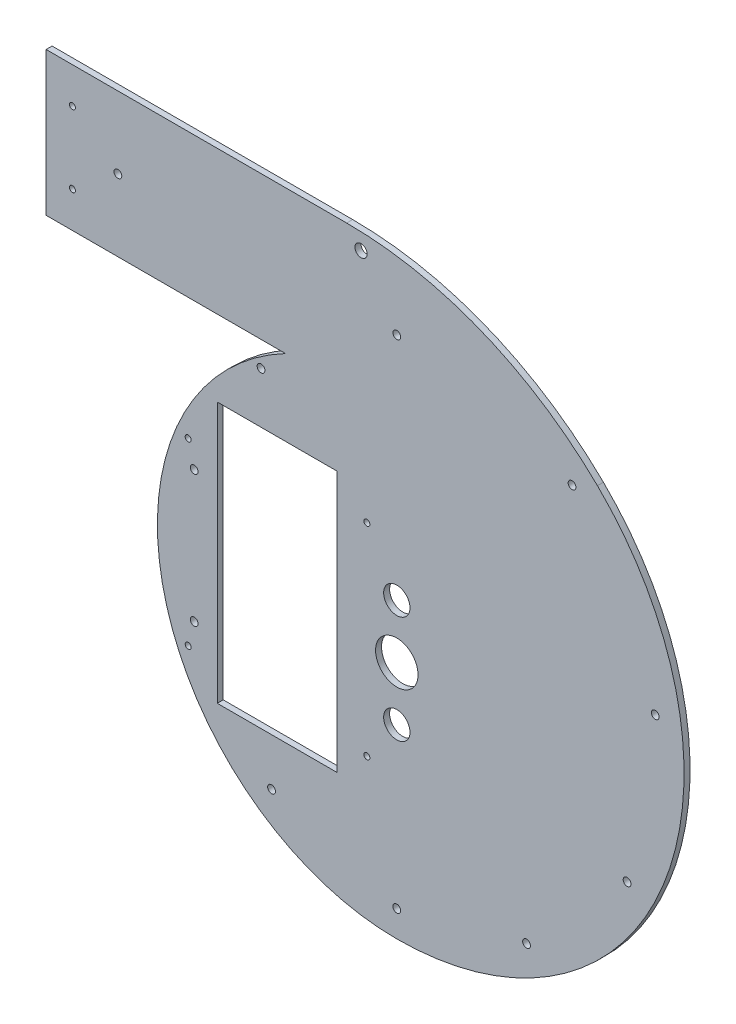
ISO-10303-21;
HEADER;
FILE_DESCRIPTION(('STEP AP214'),'2;1');
FILE_NAME('part.step','',(''),(''),'','','');
FILE_SCHEMA(('AUTOMOTIVE_DESIGN { 1 0 10303 214 1 1 1 1 }'));
ENDSEC;
DATA;
#1=APPLICATION_CONTEXT('core data for automotive mechanical design processes');
#2=APPLICATION_PROTOCOL_DEFINITION('international standard','automotive_design',2000,#1);
#3=PRODUCT_CONTEXT('',#1,'mechanical');
#4=PRODUCT('Part','Part','',(#3));
#5=PRODUCT_RELATED_PRODUCT_CATEGORY('part','',(#4));
#6=PRODUCT_DEFINITION_FORMATION('','',#4);
#7=PRODUCT_DEFINITION_CONTEXT('part definition',#1,'design');
#8=PRODUCT_DEFINITION('design','',#6,#7);
#9=PRODUCT_DEFINITION_SHAPE('','',#8);
#10=(LENGTH_UNIT() NAMED_UNIT(*) SI_UNIT(.MILLI.,.METRE.));
#11=(NAMED_UNIT(*) PLANE_ANGLE_UNIT() SI_UNIT($,.RADIAN.));
#12=(NAMED_UNIT(*) SI_UNIT($,.STERADIAN.) SOLID_ANGLE_UNIT());
#13=UNCERTAINTY_MEASURE_WITH_UNIT(LENGTH_MEASURE(1.E-05),#10,'distance_accuracy_value','');
#14=(GEOMETRIC_REPRESENTATION_CONTEXT(3) GLOBAL_UNCERTAINTY_ASSIGNED_CONTEXT((#13)) GLOBAL_UNIT_ASSIGNED_CONTEXT((#10,
#11,#12)) REPRESENTATION_CONTEXT('',''));
#15=CARTESIAN_POINT('',(0.,0.,0.));
#16=DIRECTION('',(0.,0.,1.));
#17=DIRECTION('',(1.,0.,0.));
#18=AXIS2_PLACEMENT_3D('',#15,#16,#17);
#19=CARTESIAN_POINT('',(-93.006306293609,177.058823529412,-5.));
#20=DIRECTION('',(0.,-1.,0.));
#21=DIRECTION('',(0.,0.,-1.));
#22=AXIS2_PLACEMENT_3D('',#19,#20,#21);
#23=PLANE('',#22);
#24=DIRECTION('',(1.,0.,0.));
#25=VECTOR('',#24,1.);
#26=CARTESIAN_POINT('',(-93.006306293609,177.058823529412,0.));
#27=LINE('',#26,#25);
#28=CARTESIAN_POINT('',(-293.006306293609,177.058823529412,0.));
#29=VERTEX_POINT('',#28);
#30=CARTESIAN_POINT('',(-93.006306293609,177.058823529412,0.));
#31=VERTEX_POINT('',#30);
#32=EDGE_CURVE('E243',#29,#31,#27,.T.);
#33=ORIENTED_EDGE('',*,*,#32,.F.);
#34=DIRECTION('',(0.,0.,1.));
#35=VECTOR('',#34,1.);
#36=CARTESIAN_POINT('',(-293.006306293609,177.058823529412,-5.));
#37=LINE('',#36,#35);
#38=CARTESIAN_POINT('',(-293.006306293609,177.058823529412,-5.));
#39=VERTEX_POINT('',#38);
#40=EDGE_CURVE('E45',#39,#29,#37,.T.);
#41=ORIENTED_EDGE('',*,*,#40,.F.);
#42=DIRECTION('',(1.,0.,0.));
#43=VECTOR('',#42,1.);
#44=CARTESIAN_POINT('',(-93.006306293609,177.058823529412,-5.));
#45=LINE('',#44,#43);
#46=CARTESIAN_POINT('',(-93.006306293609,177.058823529412,-5.));
#47=VERTEX_POINT('',#46);
#48=EDGE_CURVE('E255',#39,#47,#45,.T.);
#49=ORIENTED_EDGE('',*,*,#48,.T.);
#50=DIRECTION('',(0.,0.,1.));
#51=VECTOR('',#50,1.);
#52=CARTESIAN_POINT('',(-93.006306293609,177.058823529412,-5.));
#53=LINE('',#52,#51);
#54=EDGE_CURVE('E11',#47,#31,#53,.T.);
#55=ORIENTED_EDGE('',*,*,#54,.T.);
#56=EDGE_LOOP('',(#33,#41,#49,#55));
#57=FACE_BOUND('',#56,.T.);
#58=ADVANCED_FACE('F36',(#57),#23,.T.);
#59=CARTESIAN_POINT('',(-293.006306293609,297.058823529412,-5.));
#60=DIRECTION('',(-1.,0.,0.));
#61=DIRECTION('',(0.,0.,1.));
#62=AXIS2_PLACEMENT_3D('',#59,#60,#61);
#63=PLANE('',#62);
#64=DIRECTION('',(0.,-1.,0.));
#65=VECTOR('',#64,1.);
#66=CARTESIAN_POINT('',(-293.006306293609,297.058823529412,0.));
#67=LINE('',#66,#65);
#68=CARTESIAN_POINT('',(-293.006306293609,297.058823529412,0.));
#69=VERTEX_POINT('',#68);
#70=EDGE_CURVE('E269',#69,#29,#67,.T.);
#71=ORIENTED_EDGE('',*,*,#70,.F.);
#72=DIRECTION('',(0.,0.,1.));
#73=VECTOR('',#72,1.);
#74=CARTESIAN_POINT('',(-293.006306293609,297.058823529412,-5.));
#75=LINE('',#74,#73);
#76=CARTESIAN_POINT('',(-293.006306293609,297.058823529412,-5.));
#77=VERTEX_POINT('',#76);
#78=EDGE_CURVE('E275',#77,#69,#75,.T.);
#79=ORIENTED_EDGE('',*,*,#78,.F.);
#80=DIRECTION('',(0.,-1.,0.));
#81=VECTOR('',#80,1.);
#82=CARTESIAN_POINT('',(-293.006306293609,297.058823529412,-5.));
#83=LINE('',#82,#81);
#84=EDGE_CURVE('E252',#77,#39,#83,.T.);
#85=ORIENTED_EDGE('',*,*,#84,.T.);
#86=ORIENTED_EDGE('',*,*,#40,.T.);
#87=EDGE_LOOP('',(#71,#79,#85,#86));
#88=FACE_BOUND('',#87,.T.);
#89=ADVANCED_FACE('F303',(#88),#63,.T.);
#90=CARTESIAN_POINT('',(-41.905314261103,297.058823529412,-5.));
#91=DIRECTION('',(0.,1.,0.));
#92=DIRECTION('',(0.,0.,1.));
#93=AXIS2_PLACEMENT_3D('',#90,#91,#92);
#94=PLANE('',#93);
#95=DIRECTION('',(-1.,0.,0.));
#96=VECTOR('',#95,1.);
#97=CARTESIAN_POINT('',(-41.905314261103,297.058823529412,0.));
#98=LINE('',#97,#96);
#99=CARTESIAN_POINT('',(-41.905314261103,297.058823529412,0.));
#100=VERTEX_POINT('',#99);
#101=EDGE_CURVE('E266',#100,#69,#98,.T.);
#102=ORIENTED_EDGE('',*,*,#101,.F.);
#103=DIRECTION('',(0.,0.,1.));
#104=VECTOR('',#103,1.);
#105=CARTESIAN_POINT('',(-41.905314261103,297.058823529412,-5.));
#106=LINE('',#105,#104);
#107=CARTESIAN_POINT('',(-41.905314261103,297.058823529412,-5.));
#108=VERTEX_POINT('',#107);
#109=EDGE_CURVE('E277',#108,#100,#106,.T.);
#110=ORIENTED_EDGE('',*,*,#109,.F.);
#111=DIRECTION('',(-1.,0.,0.));
#112=VECTOR('',#111,1.);
#113=CARTESIAN_POINT('',(-41.905314261103,297.058823529412,-5.));
#114=LINE('',#113,#112);
#115=EDGE_CURVE('E249',#108,#77,#114,.T.);
#116=ORIENTED_EDGE('',*,*,#115,.T.);
#117=ORIENTED_EDGE('',*,*,#78,.T.);
#118=EDGE_LOOP('',(#102,#110,#116,#117));
#119=FACE_BOUND('',#118,.T.);
#120=ADVANCED_FACE('F301',(#119),#94,.T.);
#121=CARTESIAN_POINT('',(-41.905314261103,-2.94117647058825,-5.));
#122=DIRECTION('',(0.,0.,1.));
#123=DIRECTION('',(1.,0.,0.));
#124=AXIS2_PLACEMENT_3D('',#121,#122,#123);
#125=CYLINDRICAL_SURFACE('',#124,300.);
#126=CARTESIAN_POINT('',(-41.905314261103,-2.94117647058825,0.));
#127=DIRECTION('',(0.,0.,1.));
#128=DIRECTION('',(1.,0.,0.));
#129=AXIS2_PLACEMENT_3D('',#126,#127,#128);
#130=CIRCLE('',#129,300.);
#131=CARTESIAN_POINT('',(167.621257044412,211.764705882353,0.));
#132=VERTEX_POINT('',#131);
#133=EDGE_CURVE('E263',#132,#100,#130,.T.);
#134=ORIENTED_EDGE('',*,*,#133,.F.);
#135=DIRECTION('',(0.,0.,1.));
#136=VECTOR('',#135,1.);
#137=CARTESIAN_POINT('',(167.621257044412,211.764705882353,-5.));
#138=LINE('',#137,#136);
#139=CARTESIAN_POINT('',(167.621257044412,211.764705882353,-5.));
#140=VERTEX_POINT('',#139);
#141=EDGE_CURVE('E278',#140,#132,#138,.T.);
#142=ORIENTED_EDGE('',*,*,#141,.F.);
#143=CARTESIAN_POINT('',(-41.905314261103,-2.94117647058825,-5.));
#144=DIRECTION('',(0.,0.,1.));
#145=DIRECTION('',(1.,0.,0.));
#146=AXIS2_PLACEMENT_3D('',#143,#144,#145);
#147=CIRCLE('',#146,300.);
#148=EDGE_CURVE('E246',#140,#108,#147,.T.);
#149=ORIENTED_EDGE('',*,*,#148,.T.);
#150=ORIENTED_EDGE('',*,*,#109,.T.);
#151=EDGE_LOOP('',(#134,#142,#149,#150));
#152=FACE_BOUND('',#151,.T.);
#153=ADVANCED_FACE('F298',(#152),#125,.T.);
#154=CARTESIAN_POINT('',(0.,40.,-5.));
#155=DIRECTION('',(0.,0.,1.));
#156=DIRECTION('',(1.,0.,0.));
#157=AXIS2_PLACEMENT_3D('',#154,#155,#156);
#158=CYLINDRICAL_SURFACE('',#157,240.);
#159=CARTESIAN_POINT('',(0.,40.,0.));
#160=DIRECTION('',(0.,0.,1.));
#161=DIRECTION('',(1.,0.,0.));
#162=AXIS2_PLACEMENT_3D('',#159,#160,#161);
#163=CIRCLE('',#162,240.);
#164=CARTESIAN_POINT('',(0.,-200.,0.));
#165=VERTEX_POINT('',#164);
#166=EDGE_CURVE('E260',#165,#132,#163,.T.);
#167=ORIENTED_EDGE('',*,*,#166,.F.);
#168=DIRECTION('',(0.,0.,1.));
#169=VECTOR('',#168,1.);
#170=CARTESIAN_POINT('',(0.,-200.,-5.));
#171=LINE('',#170,#169);
#172=CARTESIAN_POINT('',(0.,-200.,-5.));
#173=VERTEX_POINT('',#172);
#174=EDGE_CURVE('E40',#173,#165,#171,.T.);
#175=ORIENTED_EDGE('',*,*,#174,.F.);
#176=CARTESIAN_POINT('',(0.,40.,-5.));
#177=DIRECTION('',(0.,0.,1.));
#178=DIRECTION('',(1.,0.,0.));
#179=AXIS2_PLACEMENT_3D('',#176,#177,#178);
#180=CIRCLE('',#179,240.);
#181=EDGE_CURVE('E242',#173,#140,#180,.T.);
#182=ORIENTED_EDGE('',*,*,#181,.T.);
#183=ORIENTED_EDGE('',*,*,#141,.T.);
#184=EDGE_LOOP('',(#167,#175,#182,#183));
#185=FACE_BOUND('',#184,.T.);
#186=ADVANCED_FACE('F286',(#185),#158,.T.);
#187=CARTESIAN_POINT('',(0.,0.,-5.));
#188=DIRECTION('',(0.,0.,1.));
#189=DIRECTION('',(1.,0.,0.));
#190=AXIS2_PLACEMENT_3D('',#187,#188,#189);
#191=CYLINDRICAL_SURFACE('',#190,200.);
#192=CARTESIAN_POINT('',(0.,0.,0.));
#193=DIRECTION('',(0.,0.,1.));
#194=DIRECTION('',(1.,0.,0.));
#195=AXIS2_PLACEMENT_3D('',#192,#193,#194);
#196=CIRCLE('',#195,200.);
#197=EDGE_CURVE('E237',#31,#165,#196,.T.);
#198=ORIENTED_EDGE('',*,*,#197,.F.);
#199=ORIENTED_EDGE('',*,*,#54,.F.);
#200=CARTESIAN_POINT('',(0.,0.,-5.));
#201=DIRECTION('',(0.,0.,1.));
#202=DIRECTION('',(-1.,0.,0.));
#203=AXIS2_PLACEMENT_3D('',#200,#201,#202);
#204=CIRCLE('',#203,200.);
#205=EDGE_CURVE('E240',#47,#173,#204,.T.);
#206=ORIENTED_EDGE('',*,*,#205,.T.);
#207=ORIENTED_EDGE('',*,*,#174,.T.);
#208=EDGE_LOOP('',(#198,#199,#206,#207));
#209=FACE_BOUND('',#208,.T.);
#210=ADVANCED_FACE('F38',(#209),#191,.T.);
#211=CARTESIAN_POINT('',(0.,0.,-5.));
#212=DIRECTION('',(0.,0.,-1.));
#213=DIRECTION('',(-1.,0.,0.));
#214=AXIS2_PLACEMENT_3D('',#211,#212,#213);
#215=PLANE('',#214);
#216=CARTESIAN_POINT('',(-271.006306293609,207.058823529412,-5.));
#217=DIRECTION('',(0.,0.,1.));
#218=DIRECTION('',(1.,0.,0.));
#219=AXIS2_PLACEMENT_3D('',#216,#217,#218);
#220=CIRCLE('',#219,2.50000000000002);
#221=CARTESIAN_POINT('',(-268.506306293609,207.058823529412,-5.));
#222=VERTEX_POINT('',#221);
#223=EDGE_CURVE('E430',#222,#222,#220,.T.);
#224=ORIENTED_EDGE('',*,*,#223,.T.);
#225=EDGE_LOOP('',(#224));
#226=FACE_BOUND('',#225,.T.);
#227=CARTESIAN_POINT('',(-271.006306293609,267.058823529412,-5.));
#228=DIRECTION('',(0.,0.,1.));
#229=DIRECTION('',(-1.,0.,0.));
#230=AXIS2_PLACEMENT_3D('',#227,#228,#229);
#231=CIRCLE('',#230,2.50000000000002);
#232=CARTESIAN_POINT('',(-273.506306293609,267.058823529412,-5.));
#233=VERTEX_POINT('',#232);
#234=EDGE_CURVE('E434',#233,#233,#231,.T.);
#235=ORIENTED_EDGE('',*,*,#234,.T.);
#236=EDGE_LOOP('',(#235));
#237=FACE_BOUND('',#236,.T.);
#238=CARTESIAN_POINT('',(-25.,-80.3,-5.));
#239=DIRECTION('',(0.,0.,-1.));
#240=DIRECTION('',(-1.,0.,0.));
#241=AXIS2_PLACEMENT_3D('',#238,#239,#240);
#242=CIRCLE('',#241,2.5);
#243=CARTESIAN_POINT('',(-27.5,-80.3,-5.));
#244=VERTEX_POINT('',#243);
#245=EDGE_CURVE('E436',#244,#244,#242,.F.);
#246=ORIENTED_EDGE('',*,*,#245,.T.);
#247=EDGE_LOOP('',(#246));
#248=FACE_BOUND('',#247,.T.);
#249=CARTESIAN_POINT('',(-25.,88.7,-5.));
#250=DIRECTION('',(0.,0.,-1.));
#251=DIRECTION('',(-1.,0.,0.));
#252=AXIS2_PLACEMENT_3D('',#249,#250,#251);
#253=CIRCLE('',#252,2.5);
#254=CARTESIAN_POINT('',(-27.5,88.7,-5.));
#255=VERTEX_POINT('',#254);
#256=EDGE_CURVE('E454',#255,#255,#253,.F.);
#257=ORIENTED_EDGE('',*,*,#256,.T.);
#258=EDGE_LOOP('',(#257));
#259=FACE_BOUND('',#258,.T.);
#260=CARTESIAN_POINT('',(-174.288059900537,-75.0050249987407,-5.));
#261=DIRECTION('',(0.,0.,-1.));
#262=DIRECTION('',(-1.,0.,0.));
#263=AXIS2_PLACEMENT_3D('',#260,#261,#262);
#264=CIRCLE('',#263,2.5);
#265=CARTESIAN_POINT('',(-176.788059900537,-75.0050249987407,-5.));
#266=VERTEX_POINT('',#265);
#267=EDGE_CURVE('E448',#266,#266,#264,.F.);
#268=ORIENTED_EDGE('',*,*,#267,.T.);
#269=EDGE_LOOP('',(#268));
#270=FACE_BOUND('',#269,.T.);
#271=CARTESIAN_POINT('',(-174.288059900537,75.0050249987407,-5.));
#272=DIRECTION('',(0.,0.,-1.));
#273=DIRECTION('',(-1.,0.,0.));
#274=AXIS2_PLACEMENT_3D('',#271,#272,#273);
#275=CIRCLE('',#274,2.5);
#276=CARTESIAN_POINT('',(-176.788059900537,75.0050249987407,-5.));
#277=VERTEX_POINT('',#276);
#278=EDGE_CURVE('E447',#277,#277,#275,.F.);
#279=ORIENTED_EDGE('',*,*,#278,.T.);
#280=EDGE_LOOP('',(#279));
#281=FACE_BOUND('',#280,.T.);
#282=DIRECTION('',(0.,-1.,0.));
#283=VECTOR('',#282,1.);
#284=CARTESIAN_POINT('',(-150.,113.5,-5.));
#285=LINE('',#284,#283);
#286=CARTESIAN_POINT('',(-150.,113.5,-5.));
#287=VERTEX_POINT('',#286);
#288=CARTESIAN_POINT('',(-150.,-104.5,-5.));
#289=VERTEX_POINT('',#288);
#290=EDGE_CURVE('E125',#287,#289,#285,.T.);
#291=ORIENTED_EDGE('',*,*,#290,.T.);
#292=DIRECTION('',(1.,0.,0.));
#293=VECTOR('',#292,1.);
#294=CARTESIAN_POINT('',(-150.,-104.5,-5.));
#295=LINE('',#294,#293);
#296=CARTESIAN_POINT('',(-50.,-104.5,-5.));
#297=VERTEX_POINT('',#296);
#298=EDGE_CURVE('E114',#289,#297,#295,.T.);
#299=ORIENTED_EDGE('',*,*,#298,.T.);
#300=DIRECTION('',(0.,1.,0.));
#301=VECTOR('',#300,1.);
#302=CARTESIAN_POINT('',(-50.,113.5,-5.));
#303=LINE('',#302,#301);
#304=CARTESIAN_POINT('',(-50.,113.5,-5.));
#305=VERTEX_POINT('',#304);
#306=EDGE_CURVE('E136',#297,#305,#303,.T.);
#307=ORIENTED_EDGE('',*,*,#306,.T.);
#308=DIRECTION('',(-1.,0.,0.));
#309=VECTOR('',#308,1.);
#310=CARTESIAN_POINT('',(-150.,113.5,-5.));
#311=LINE('',#310,#309);
#312=EDGE_CURVE('E132',#305,#287,#311,.T.);
#313=ORIENTED_EDGE('',*,*,#312,.T.);
#314=EDGE_LOOP('',(#291,#299,#307,#313));
#315=FACE_BOUND('',#314,.T.);
#316=CARTESIAN_POINT('',(192.393369960535,-62.5123953248023,-5.));
#317=DIRECTION('',(0.,0.,-1.));
#318=DIRECTION('',(-1.,0.,0.));
#319=AXIS2_PLACEMENT_3D('',#316,#317,#318);
#320=CIRCLE('',#319,3.25);
#321=CARTESIAN_POINT('',(189.143369960535,-62.5123953248023,-5.));
#322=VERTEX_POINT('',#321);
#323=EDGE_CURVE('E212',#322,#322,#320,.T.);
#324=ORIENTED_EDGE('',*,*,#323,.F.);
#325=EDGE_LOOP('',(#324));
#326=FACE_BOUND('',#325,.T.);
#327=CARTESIAN_POINT('',(215.904780052234,70.1517155498044,-5.));
#328=DIRECTION('',(0.,0.,-1.));
#329=DIRECTION('',(-1.,0.,0.));
#330=AXIS2_PLACEMENT_3D('',#327,#328,#329);
#331=CIRCLE('',#330,3.25000000000001);
#332=CARTESIAN_POINT('',(212.654780052234,70.1517155498044,-5.));
#333=VERTEX_POINT('',#332);
#334=EDGE_CURVE('E209',#333,#333,#331,.T.);
#335=ORIENTED_EDGE('',*,*,#334,.F.);
#336=EDGE_LOOP('',(#335));
#337=FACE_BOUND('',#336,.T.);
#338=CARTESIAN_POINT('',(146.429769795033,201.543287764639,-5.));
#339=DIRECTION('',(0.,0.,-1.));
#340=DIRECTION('',(-1.,0.,0.));
#341=AXIS2_PLACEMENT_3D('',#338,#339,#340);
#342=CIRCLE('',#341,3.25000000000001);
#343=CARTESIAN_POINT('',(143.179769795033,201.543287764639,-5.));
#344=VERTEX_POINT('',#343);
#345=EDGE_CURVE('E206',#344,#344,#342,.T.);
#346=ORIENTED_EDGE('',*,*,#345,.F.);
#347=EDGE_LOOP('',(#346));
#348=FACE_BOUND('',#347,.T.);
#349=CARTESIAN_POINT('',(-233.006306293609,237.058823529412,-5.));
#350=DIRECTION('',(0.,0.,-1.));
#351=DIRECTION('',(-1.,0.,0.));
#352=AXIS2_PLACEMENT_3D('',#349,#350,#351);
#353=CIRCLE('',#352,3.25000000000001);
#354=CARTESIAN_POINT('',(-236.256306293609,237.058823529412,-5.));
#355=VERTEX_POINT('',#354);
#356=EDGE_CURVE('E203',#355,#355,#353,.T.);
#357=ORIENTED_EDGE('',*,*,#356,.F.);
#358=EDGE_LOOP('',(#357));
#359=FACE_BOUND('',#358,.T.);
#360=CARTESIAN_POINT('',(0.,237.058823529412,-5.));
#361=DIRECTION('',(0.,0.,-1.));
#362=DIRECTION('',(-1.,0.,0.));
#363=AXIS2_PLACEMENT_3D('',#360,#361,#362);
#364=CIRCLE('',#363,3.25);
#365=CARTESIAN_POINT('',(-3.25,237.058823529412,-5.));
#366=VERTEX_POINT('',#365);
#367=EDGE_CURVE('E200',#366,#366,#364,.T.);
#368=ORIENTED_EDGE('',*,*,#367,.F.);
#369=EDGE_LOOP('',(#368));
#370=FACE_BOUND('',#369,.T.);
#371=CARTESIAN_POINT('',(-169.288059900537,55.0050249987407,-5.));
#372=DIRECTION('',(0.,0.,-1.));
#373=DIRECTION('',(-1.,0.,0.));
#374=AXIS2_PLACEMENT_3D('',#371,#372,#373);
#375=CIRCLE('',#374,3.24999999999998);
#376=CARTESIAN_POINT('',(-172.538059900537,55.0050249987407,-5.));
#377=VERTEX_POINT('',#376);
#378=EDGE_CURVE('E197',#377,#377,#375,.T.);
#379=ORIENTED_EDGE('',*,*,#378,.F.);
#380=EDGE_LOOP('',(#379));
#381=FACE_BOUND('',#380,.T.);
#382=CARTESIAN_POINT('',(0.,-178.,-5.));
#383=DIRECTION('',(0.,0.,-1.));
#384=DIRECTION('',(-1.,0.,0.));
#385=AXIS2_PLACEMENT_3D('',#382,#383,#384);
#386=CIRCLE('',#385,3.25);
#387=CARTESIAN_POINT('',(-3.25000000000005,-178.,-5.));
#388=VERTEX_POINT('',#387);
#389=EDGE_CURVE('E194',#388,#388,#386,.T.);
#390=ORIENTED_EDGE('',*,*,#389,.F.);
#391=EDGE_LOOP('',(#390));
#392=FACE_BOUND('',#391,.T.);
#393=CARTESIAN_POINT('',(-104.62577490806,-144.005024998741,-5.));
#394=DIRECTION('',(0.,0.,-1.));
#395=DIRECTION('',(-1.,0.,0.));
#396=AXIS2_PLACEMENT_3D('',#393,#394,#395);
#397=CIRCLE('',#396,3.25000000000008);
#398=CARTESIAN_POINT('',(-107.87577490806,-144.005024998741,-5.));
#399=VERTEX_POINT('',#398);
#400=EDGE_CURVE('E191',#399,#399,#397,.T.);
#401=ORIENTED_EDGE('',*,*,#400,.F.);
#402=EDGE_LOOP('',(#401));
#403=FACE_BOUND('',#402,.T.);
#404=CARTESIAN_POINT('',(108.368646242067,-149.156645433518,-5.));
#405=DIRECTION('',(0.,0.,-1.));
#406=DIRECTION('',(-1.,0.,0.));
#407=AXIS2_PLACEMENT_3D('',#404,#405,#406);
#408=CIRCLE('',#407,3.25000000000001);
#409=CARTESIAN_POINT('',(105.118646242067,-149.156645433518,-5.));
#410=VERTEX_POINT('',#409);
#411=EDGE_CURVE('E188',#410,#410,#408,.T.);
#412=ORIENTED_EDGE('',*,*,#411,.F.);
#413=EDGE_LOOP('',(#412));
#414=FACE_BOUND('',#413,.T.);
#415=CARTESIAN_POINT('',(-113.442553692447,156.140279914365,-5.));
#416=DIRECTION('',(0.,0.,-1.));
#417=DIRECTION('',(-1.,0.,0.));
#418=AXIS2_PLACEMENT_3D('',#415,#416,#417);
#419=CIRCLE('',#418,3.25000000000001);
#420=CARTESIAN_POINT('',(-116.692553692447,156.140279914365,-5.));
#421=VERTEX_POINT('',#420);
#422=EDGE_CURVE('E185',#421,#421,#419,.T.);
#423=ORIENTED_EDGE('',*,*,#422,.F.);
#424=EDGE_LOOP('',(#423));
#425=FACE_BOUND('',#424,.T.);
#426=CARTESIAN_POINT('',(-169.288059900537,-55.0050249987406,-5.));
#427=DIRECTION('',(0.,0.,-1.));
#428=DIRECTION('',(-1.,0.,0.));
#429=AXIS2_PLACEMENT_3D('',#426,#427,#428);
#430=CIRCLE('',#429,3.25000000000002);
#431=CARTESIAN_POINT('',(-172.538059900537,-55.0050249987406,-5.));
#432=VERTEX_POINT('',#431);
#433=EDGE_CURVE('E182',#432,#432,#430,.T.);
#434=ORIENTED_EDGE('',*,*,#433,.F.);
#435=EDGE_LOOP('',(#434));
#436=FACE_BOUND('',#435,.T.);
#437=CARTESIAN_POINT('',(0.,45.,-5.));
#438=DIRECTION('',(0.,0.,-1.));
#439=DIRECTION('',(-1.,0.,0.));
#440=AXIS2_PLACEMENT_3D('',#437,#438,#439);
#441=CIRCLE('',#440,11.);
#442=CARTESIAN_POINT('',(-11.,45.,-5.));
#443=VERTEX_POINT('',#442);
#444=EDGE_CURVE('E224',#443,#443,#441,.T.);
#445=ORIENTED_EDGE('',*,*,#444,.F.);
#446=EDGE_LOOP('',(#445));
#447=FACE_BOUND('',#446,.T.);
#448=CARTESIAN_POINT('',(0.,-45.,-5.));
#449=DIRECTION('',(0.,0.,-1.));
#450=DIRECTION('',(-1.,0.,0.));
#451=AXIS2_PLACEMENT_3D('',#448,#449,#450);
#452=CIRCLE('',#451,11.);
#453=CARTESIAN_POINT('',(-11.,-45.,-5.));
#454=VERTEX_POINT('',#453);
#455=EDGE_CURVE('E219',#454,#454,#452,.T.);
#456=ORIENTED_EDGE('',*,*,#455,.F.);
#457=EDGE_LOOP('',(#456));
#458=FACE_BOUND('',#457,.T.);
#459=CARTESIAN_POINT('',(0.,0.,-5.));
#460=DIRECTION('',(0.,0.,-1.));
#461=DIRECTION('',(-1.,0.,0.));
#462=AXIS2_PLACEMENT_3D('',#459,#460,#461);
#463=CIRCLE('',#462,17.75);
#464=CARTESIAN_POINT('',(-17.75,0.,-5.));
#465=VERTEX_POINT('',#464);
#466=EDGE_CURVE('E230',#465,#465,#463,.T.);
#467=ORIENTED_EDGE('',*,*,#466,.F.);
#468=EDGE_LOOP('',(#467));
#469=FACE_BOUND('',#468,.T.);
#470=CARTESIAN_POINT('',(-29.905314261103,283.058823529412,-5.));
#471=DIRECTION('',(0.,0.,1.));
#472=DIRECTION('',(1.,0.,0.));
#473=AXIS2_PLACEMENT_3D('',#470,#471,#472);
#474=CIRCLE('',#473,5.1);
#475=CARTESIAN_POINT('',(-24.805314261103,283.058823529412,-5.));
#476=VERTEX_POINT('',#475);
#477=EDGE_CURVE('E234',#476,#476,#474,.T.);
#478=ORIENTED_EDGE('',*,*,#477,.T.);
#479=EDGE_LOOP('',(#478));
#480=FACE_BOUND('',#479,.T.);
#481=ORIENTED_EDGE('',*,*,#205,.F.);
#482=ORIENTED_EDGE('',*,*,#48,.F.);
#483=ORIENTED_EDGE('',*,*,#84,.F.);
#484=ORIENTED_EDGE('',*,*,#115,.F.);
#485=ORIENTED_EDGE('',*,*,#148,.F.);
#486=ORIENTED_EDGE('',*,*,#181,.F.);
#487=EDGE_LOOP('',(#481,#482,#483,#484,#485,#486));
#488=FACE_BOUND('',#487,.T.);
#489=ADVANCED_FACE('F130',(#226,#237,#248,#259,#270,#281,#315,#326,#337,#348,#359,#370,#381,
#392,#403,#414,#425,#436,#447,#458,#469,#480,#488),#215,.T.);
#490=CARTESIAN_POINT('',(0.,0.,0.));
#491=DIRECTION('',(0.,0.,-1.));
#492=DIRECTION('',(-1.,0.,0.));
#493=AXIS2_PLACEMENT_3D('',#490,#491,#492);
#494=PLANE('',#493);
#495=CARTESIAN_POINT('',(-271.006306293609,207.058823529412,0.));
#496=DIRECTION('',(0.,0.,1.));
#497=DIRECTION('',(1.,0.,0.));
#498=AXIS2_PLACEMENT_3D('',#495,#496,#497);
#499=CIRCLE('',#498,2.50000000000002);
#500=CARTESIAN_POINT('',(-268.506306293609,207.058823529412,0.));
#501=VERTEX_POINT('',#500);
#502=EDGE_CURVE('E433',#501,#501,#499,.T.);
#503=ORIENTED_EDGE('',*,*,#502,.F.);
#504=EDGE_LOOP('',(#503));
#505=FACE_BOUND('',#504,.T.);
#506=CARTESIAN_POINT('',(-271.006306293609,267.058823529412,0.));
#507=DIRECTION('',(0.,0.,1.));
#508=DIRECTION('',(-1.,0.,0.));
#509=AXIS2_PLACEMENT_3D('',#506,#507,#508);
#510=CIRCLE('',#509,2.50000000000002);
#511=CARTESIAN_POINT('',(-273.506306293609,267.058823529412,0.));
#512=VERTEX_POINT('',#511);
#513=EDGE_CURVE('E439',#512,#512,#510,.T.);
#514=ORIENTED_EDGE('',*,*,#513,.F.);
#515=EDGE_LOOP('',(#514));
#516=FACE_BOUND('',#515,.T.);
#517=CARTESIAN_POINT('',(-25.,-80.3,0.));
#518=DIRECTION('',(0.,0.,1.));
#519=DIRECTION('',(1.,0.,0.));
#520=AXIS2_PLACEMENT_3D('',#517,#518,#519);
#521=CIRCLE('',#520,2.5);
#522=CARTESIAN_POINT('',(-22.5,-80.3,0.));
#523=VERTEX_POINT('',#522);
#524=EDGE_CURVE('E457',#523,#523,#521,.T.);
#525=ORIENTED_EDGE('',*,*,#524,.F.);
#526=EDGE_LOOP('',(#525));
#527=FACE_BOUND('',#526,.T.);
#528=CARTESIAN_POINT('',(-25.,88.7,0.));
#529=DIRECTION('',(0.,0.,1.));
#530=DIRECTION('',(1.,0.,0.));
#531=AXIS2_PLACEMENT_3D('',#528,#529,#530);
#532=CIRCLE('',#531,2.5);
#533=CARTESIAN_POINT('',(-22.5,88.7,0.));
#534=VERTEX_POINT('',#533);
#535=EDGE_CURVE('E451',#534,#534,#532,.T.);
#536=ORIENTED_EDGE('',*,*,#535,.F.);
#537=EDGE_LOOP('',(#536));
#538=FACE_BOUND('',#537,.T.);
#539=CARTESIAN_POINT('',(-174.288059900537,-75.0050249987407,0.));
#540=DIRECTION('',(0.,0.,1.));
#541=DIRECTION('',(-1.,0.,0.));
#542=AXIS2_PLACEMENT_3D('',#539,#540,#541);
#543=CIRCLE('',#542,2.5);
#544=CARTESIAN_POINT('',(-176.788059900537,-75.0050249987407,0.));
#545=VERTEX_POINT('',#544);
#546=EDGE_CURVE('E444',#545,#545,#543,.T.);
#547=ORIENTED_EDGE('',*,*,#546,.F.);
#548=EDGE_LOOP('',(#547));
#549=FACE_BOUND('',#548,.T.);
#550=CARTESIAN_POINT('',(-174.288059900537,75.0050249987407,0.));
#551=DIRECTION('',(0.,0.,1.));
#552=DIRECTION('',(1.,0.,0.));
#553=AXIS2_PLACEMENT_3D('',#550,#551,#552);
#554=CIRCLE('',#553,2.5);
#555=CARTESIAN_POINT('',(-171.788059900537,75.0050249987407,0.));
#556=VERTEX_POINT('',#555);
#557=EDGE_CURVE('E462',#556,#556,#554,.T.);
#558=ORIENTED_EDGE('',*,*,#557,.F.);
#559=EDGE_LOOP('',(#558));
#560=FACE_BOUND('',#559,.T.);
#561=DIRECTION('',(1.,0.,0.));
#562=VECTOR('',#561,1.);
#563=CARTESIAN_POINT('',(-150.,-104.5,0.));
#564=LINE('',#563,#562);
#565=CARTESIAN_POINT('',(-150.,-104.5,0.));
#566=VERTEX_POINT('',#565);
#567=CARTESIAN_POINT('',(-50.,-104.5,0.));
#568=VERTEX_POINT('',#567);
#569=EDGE_CURVE('E134',#566,#568,#564,.T.);
#570=ORIENTED_EDGE('',*,*,#569,.F.);
#571=DIRECTION('',(0.,-1.,0.));
#572=VECTOR('',#571,1.);
#573=CARTESIAN_POINT('',(-150.,113.5,0.));
#574=LINE('',#573,#572);
#575=CARTESIAN_POINT('',(-150.,113.5,0.));
#576=VERTEX_POINT('',#575);
#577=EDGE_CURVE('E61',#576,#566,#574,.T.);
#578=ORIENTED_EDGE('',*,*,#577,.F.);
#579=DIRECTION('',(-1.,0.,0.));
#580=VECTOR('',#579,1.);
#581=CARTESIAN_POINT('',(-150.,113.5,0.));
#582=LINE('',#581,#580);
#583=CARTESIAN_POINT('',(-50.,113.5,0.));
#584=VERTEX_POINT('',#583);
#585=EDGE_CURVE('E127',#584,#576,#582,.T.);
#586=ORIENTED_EDGE('',*,*,#585,.F.);
#587=DIRECTION('',(0.,1.,0.));
#588=VECTOR('',#587,1.);
#589=CARTESIAN_POINT('',(-50.,113.5,0.));
#590=LINE('',#589,#588);
#591=EDGE_CURVE('E141',#568,#584,#590,.T.);
#592=ORIENTED_EDGE('',*,*,#591,.F.);
#593=EDGE_LOOP('',(#570,#578,#586,#592));
#594=FACE_BOUND('',#593,.T.);
#595=CARTESIAN_POINT('',(192.393369960535,-62.5123953248023,0.));
#596=DIRECTION('',(0.,0.,1.));
#597=DIRECTION('',(1.,0.,0.));
#598=AXIS2_PLACEMENT_3D('',#595,#596,#597);
#599=CIRCLE('',#598,3.25);
#600=CARTESIAN_POINT('',(195.643369960535,-62.5123953248023,0.));
#601=VERTEX_POINT('',#600);
#602=EDGE_CURVE('E153',#601,#601,#599,.T.);
#603=ORIENTED_EDGE('',*,*,#602,.F.);
#604=EDGE_LOOP('',(#603));
#605=FACE_BOUND('',#604,.T.);
#606=CARTESIAN_POINT('',(215.904780052234,70.1517155498044,0.));
#607=DIRECTION('',(0.,0.,1.));
#608=DIRECTION('',(1.,0.,0.));
#609=AXIS2_PLACEMENT_3D('',#606,#607,#608);
#610=CIRCLE('',#609,3.25000000000001);
#611=CARTESIAN_POINT('',(219.154780052234,70.1517155498044,0.));
#612=VERTEX_POINT('',#611);
#613=EDGE_CURVE('E163',#612,#612,#610,.T.);
#614=ORIENTED_EDGE('',*,*,#613,.F.);
#615=EDGE_LOOP('',(#614));
#616=FACE_BOUND('',#615,.T.);
#617=CARTESIAN_POINT('',(146.429769795033,201.543287764639,0.));
#618=DIRECTION('',(0.,0.,1.));
#619=DIRECTION('',(1.,0.,0.));
#620=AXIS2_PLACEMENT_3D('',#617,#618,#619);
#621=CIRCLE('',#620,3.25000000000001);
#622=CARTESIAN_POINT('',(149.679769795033,201.543287764639,0.));
#623=VERTEX_POINT('',#622);
#624=EDGE_CURVE('E160',#623,#623,#621,.T.);
#625=ORIENTED_EDGE('',*,*,#624,.F.);
#626=EDGE_LOOP('',(#625));
#627=FACE_BOUND('',#626,.T.);
#628=CARTESIAN_POINT('',(-233.006306293609,237.058823529412,0.));
#629=DIRECTION('',(0.,0.,1.));
#630=DIRECTION('',(1.,0.,0.));
#631=AXIS2_PLACEMENT_3D('',#628,#629,#630);
#632=CIRCLE('',#631,3.25000000000001);
#633=CARTESIAN_POINT('',(-229.756306293609,237.058823529412,0.));
#634=VERTEX_POINT('',#633);
#635=EDGE_CURVE('E156',#634,#634,#632,.T.);
#636=ORIENTED_EDGE('',*,*,#635,.F.);
#637=EDGE_LOOP('',(#636));
#638=FACE_BOUND('',#637,.T.);
#639=CARTESIAN_POINT('',(0.,237.058823529412,0.));
#640=DIRECTION('',(0.,0.,1.));
#641=DIRECTION('',(1.,0.,0.));
#642=AXIS2_PLACEMENT_3D('',#639,#640,#641);
#643=CIRCLE('',#642,3.25);
#644=CARTESIAN_POINT('',(3.25,237.058823529412,0.));
#645=VERTEX_POINT('',#644);
#646=EDGE_CURVE('E159',#645,#645,#643,.T.);
#647=ORIENTED_EDGE('',*,*,#646,.F.);
#648=EDGE_LOOP('',(#647));
#649=FACE_BOUND('',#648,.T.);
#650=CARTESIAN_POINT('',(-169.288059900537,55.0050249987407,0.));
#651=DIRECTION('',(0.,0.,1.));
#652=DIRECTION('',(1.,0.,0.));
#653=AXIS2_PLACEMENT_3D('',#650,#651,#652);
#654=CIRCLE('',#653,3.24999999999998);
#655=CARTESIAN_POINT('',(-166.038059900537,55.0050249987407,0.));
#656=VERTEX_POINT('',#655);
#657=EDGE_CURVE('E175',#656,#656,#654,.T.);
#658=ORIENTED_EDGE('',*,*,#657,.F.);
#659=EDGE_LOOP('',(#658));
#660=FACE_BOUND('',#659,.T.);
#661=CARTESIAN_POINT('',(0.,-178.,0.));
#662=DIRECTION('',(0.,0.,1.));
#663=DIRECTION('',(1.,0.,0.));
#664=AXIS2_PLACEMENT_3D('',#661,#662,#663);
#665=CIRCLE('',#664,3.25);
#666=CARTESIAN_POINT('',(3.24999999999996,-178.,0.));
#667=VERTEX_POINT('',#666);
#668=EDGE_CURVE('E172',#667,#667,#665,.T.);
#669=ORIENTED_EDGE('',*,*,#668,.F.);
#670=EDGE_LOOP('',(#669));
#671=FACE_BOUND('',#670,.T.);
#672=CARTESIAN_POINT('',(-104.62577490806,-144.005024998741,0.));
#673=DIRECTION('',(0.,0.,1.));
#674=DIRECTION('',(1.,0.,0.));
#675=AXIS2_PLACEMENT_3D('',#672,#673,#674);
#676=CIRCLE('',#675,3.25000000000008);
#677=CARTESIAN_POINT('',(-101.37577490806,-144.005024998741,0.));
#678=VERTEX_POINT('',#677);
#679=EDGE_CURVE('E168',#678,#678,#676,.T.);
#680=ORIENTED_EDGE('',*,*,#679,.F.);
#681=EDGE_LOOP('',(#680));
#682=FACE_BOUND('',#681,.T.);
#683=CARTESIAN_POINT('',(108.368646242067,-149.156645433518,0.));
#684=DIRECTION('',(0.,0.,1.));
#685=DIRECTION('',(1.,0.,0.));
#686=AXIS2_PLACEMENT_3D('',#683,#684,#685);
#687=CIRCLE('',#686,3.25000000000001);
#688=CARTESIAN_POINT('',(111.618646242067,-149.156645433518,0.));
#689=VERTEX_POINT('',#688);
#690=EDGE_CURVE('E150',#689,#689,#687,.T.);
#691=ORIENTED_EDGE('',*,*,#690,.F.);
#692=EDGE_LOOP('',(#691));
#693=FACE_BOUND('',#692,.T.);
#694=CARTESIAN_POINT('',(-113.442553692447,156.140279914365,0.));
#695=DIRECTION('',(0.,0.,1.));
#696=DIRECTION('',(1.,0.,0.));
#697=AXIS2_PLACEMENT_3D('',#694,#695,#696);
#698=CIRCLE('',#697,3.25000000000001);
#699=CARTESIAN_POINT('',(-110.192553692447,156.140279914365,0.));
#700=VERTEX_POINT('',#699);
#701=EDGE_CURVE('E121',#700,#700,#698,.T.);
#702=ORIENTED_EDGE('',*,*,#701,.F.);
#703=EDGE_LOOP('',(#702));
#704=FACE_BOUND('',#703,.T.);
#705=CARTESIAN_POINT('',(-169.288059900537,-55.0050249987406,0.));
#706=DIRECTION('',(0.,0.,1.));
#707=DIRECTION('',(1.,0.,0.));
#708=AXIS2_PLACEMENT_3D('',#705,#706,#707);
#709=CIRCLE('',#708,3.25000000000002);
#710=CARTESIAN_POINT('',(-166.038059900537,-55.0050249987406,0.));
#711=VERTEX_POINT('',#710);
#712=EDGE_CURVE('E171',#711,#711,#709,.T.);
#713=ORIENTED_EDGE('',*,*,#712,.F.);
#714=EDGE_LOOP('',(#713));
#715=FACE_BOUND('',#714,.T.);
#716=CARTESIAN_POINT('',(0.,45.,0.));
#717=DIRECTION('',(0.,0.,1.));
#718=DIRECTION('',(1.,0.,0.));
#719=AXIS2_PLACEMENT_3D('',#716,#717,#718);
#720=CIRCLE('',#719,11.);
#721=CARTESIAN_POINT('',(11.,45.,0.));
#722=VERTEX_POINT('',#721);
#723=EDGE_CURVE('E216',#722,#722,#720,.T.);
#724=ORIENTED_EDGE('',*,*,#723,.F.);
#725=EDGE_LOOP('',(#724));
#726=FACE_BOUND('',#725,.T.);
#727=CARTESIAN_POINT('',(0.,-45.,0.));
#728=DIRECTION('',(0.,0.,1.));
#729=DIRECTION('',(1.,0.,0.));
#730=AXIS2_PLACEMENT_3D('',#727,#728,#729);
#731=CIRCLE('',#730,11.);
#732=CARTESIAN_POINT('',(11.,-45.,0.));
#733=VERTEX_POINT('',#732);
#734=EDGE_CURVE('E215',#733,#733,#731,.T.);
#735=ORIENTED_EDGE('',*,*,#734,.F.);
#736=EDGE_LOOP('',(#735));
#737=FACE_BOUND('',#736,.T.);
#738=CARTESIAN_POINT('',(0.,0.,0.));
#739=DIRECTION('',(0.,0.,1.));
#740=DIRECTION('',(1.,0.,0.));
#741=AXIS2_PLACEMENT_3D('',#738,#739,#740);
#742=CIRCLE('',#741,17.75);
#743=CARTESIAN_POINT('',(17.75,0.,0.));
#744=VERTEX_POINT('',#743);
#745=EDGE_CURVE('E227',#744,#744,#742,.T.);
#746=ORIENTED_EDGE('',*,*,#745,.F.);
#747=EDGE_LOOP('',(#746));
#748=FACE_BOUND('',#747,.T.);
#749=CARTESIAN_POINT('',(-29.905314261103,283.058823529412,0.));
#750=DIRECTION('',(0.,0.,1.));
#751=DIRECTION('',(1.,0.,0.));
#752=AXIS2_PLACEMENT_3D('',#749,#750,#751);
#753=CIRCLE('',#752,5.1);
#754=CARTESIAN_POINT('',(-24.805314261103,283.058823529412,0.));
#755=VERTEX_POINT('',#754);
#756=EDGE_CURVE('E233',#755,#755,#753,.T.);
#757=ORIENTED_EDGE('',*,*,#756,.F.);
#758=EDGE_LOOP('',(#757));
#759=FACE_BOUND('',#758,.T.);
#760=ORIENTED_EDGE('',*,*,#32,.T.);
#761=ORIENTED_EDGE('',*,*,#197,.T.);
#762=ORIENTED_EDGE('',*,*,#166,.T.);
#763=ORIENTED_EDGE('',*,*,#133,.T.);
#764=ORIENTED_EDGE('',*,*,#101,.T.);
#765=ORIENTED_EDGE('',*,*,#70,.T.);
#766=EDGE_LOOP('',(#760,#761,#762,#763,#764,#765));
#767=FACE_BOUND('',#766,.T.);
#768=ADVANCED_FACE('F288',(#505,#516,#527,#538,#549,#560,#594,#605,#616,#627,#638,#649,#660,
#671,#682,#693,#704,#715,#726,#737,#748,#759,#767),#494,.F.);
#769=CARTESIAN_POINT('',(-29.905314261103,283.058823529412,-5.));
#770=DIRECTION('',(0.,0.,1.));
#771=DIRECTION('',(1.,0.,0.));
#772=AXIS2_PLACEMENT_3D('',#769,#770,#771);
#773=CYLINDRICAL_SURFACE('',#772,5.1);
#774=ORIENTED_EDGE('',*,*,#477,.F.);
#775=EDGE_LOOP('',(#774));
#776=FACE_BOUND('',#775,.T.);
#777=ORIENTED_EDGE('',*,*,#756,.T.);
#778=EDGE_LOOP('',(#777));
#779=FACE_BOUND('',#778,.T.);
#780=ADVANCED_FACE('F327',(#776,#779),#773,.F.);
#781=CARTESIAN_POINT('',(0.,0.,-10.));
#782=DIRECTION('',(0.,0.,1.));
#783=DIRECTION('',(1.,0.,0.));
#784=AXIS2_PLACEMENT_3D('',#781,#782,#783);
#785=CYLINDRICAL_SURFACE('',#784,17.75);
#786=ORIENTED_EDGE('',*,*,#466,.T.);
#787=EDGE_LOOP('',(#786));
#788=FACE_BOUND('',#787,.T.);
#789=ORIENTED_EDGE('',*,*,#745,.T.);
#790=EDGE_LOOP('',(#789));
#791=FACE_BOUND('',#790,.T.);
#792=ADVANCED_FACE('F334',(#788,#791),#785,.F.);
#793=CARTESIAN_POINT('',(0.,-45.,-10.));
#794=DIRECTION('',(0.,0.,1.));
#795=DIRECTION('',(1.,0.,0.));
#796=AXIS2_PLACEMENT_3D('',#793,#794,#795);
#797=CYLINDRICAL_SURFACE('',#796,11.);
#798=ORIENTED_EDGE('',*,*,#455,.T.);
#799=EDGE_LOOP('',(#798));
#800=FACE_BOUND('',#799,.T.);
#801=ORIENTED_EDGE('',*,*,#734,.T.);
#802=EDGE_LOOP('',(#801));
#803=FACE_BOUND('',#802,.T.);
#804=ADVANCED_FACE('F338',(#800,#803),#797,.F.);
#805=CARTESIAN_POINT('',(0.,45.,-10.));
#806=DIRECTION('',(0.,0.,1.));
#807=DIRECTION('',(1.,0.,0.));
#808=AXIS2_PLACEMENT_3D('',#805,#806,#807);
#809=CYLINDRICAL_SURFACE('',#808,11.);
#810=ORIENTED_EDGE('',*,*,#444,.T.);
#811=EDGE_LOOP('',(#810));
#812=FACE_BOUND('',#811,.T.);
#813=ORIENTED_EDGE('',*,*,#723,.T.);
#814=EDGE_LOOP('',(#813));
#815=FACE_BOUND('',#814,.T.);
#816=ADVANCED_FACE('F342',(#812,#815),#809,.F.);
#817=CARTESIAN_POINT('',(-169.288059900537,-55.0050249987406,-10.));
#818=DIRECTION('',(0.,0.,1.));
#819=DIRECTION('',(1.,0.,0.));
#820=AXIS2_PLACEMENT_3D('',#817,#818,#819);
#821=CYLINDRICAL_SURFACE('',#820,3.25000000000002);
#822=ORIENTED_EDGE('',*,*,#433,.T.);
#823=EDGE_LOOP('',(#822));
#824=FACE_BOUND('',#823,.T.);
#825=ORIENTED_EDGE('',*,*,#712,.T.);
#826=EDGE_LOOP('',(#825));
#827=FACE_BOUND('',#826,.T.);
#828=ADVANCED_FACE('F346',(#824,#827),#821,.F.);
#829=CARTESIAN_POINT('',(-113.442553692447,156.140279914365,-10.));
#830=DIRECTION('',(0.,0.,1.));
#831=DIRECTION('',(1.,0.,0.));
#832=AXIS2_PLACEMENT_3D('',#829,#830,#831);
#833=CYLINDRICAL_SURFACE('',#832,3.25000000000001);
#834=ORIENTED_EDGE('',*,*,#422,.T.);
#835=EDGE_LOOP('',(#834));
#836=FACE_BOUND('',#835,.T.);
#837=ORIENTED_EDGE('',*,*,#701,.T.);
#838=EDGE_LOOP('',(#837));
#839=FACE_BOUND('',#838,.T.);
#840=ADVANCED_FACE('F350',(#836,#839),#833,.F.);
#841=CARTESIAN_POINT('',(108.368646242067,-149.156645433518,-10.));
#842=DIRECTION('',(0.,0.,1.));
#843=DIRECTION('',(1.,0.,0.));
#844=AXIS2_PLACEMENT_3D('',#841,#842,#843);
#845=CYLINDRICAL_SURFACE('',#844,3.25000000000001);
#846=ORIENTED_EDGE('',*,*,#411,.T.);
#847=EDGE_LOOP('',(#846));
#848=FACE_BOUND('',#847,.T.);
#849=ORIENTED_EDGE('',*,*,#690,.T.);
#850=EDGE_LOOP('',(#849));
#851=FACE_BOUND('',#850,.T.);
#852=ADVANCED_FACE('F368',(#848,#851),#845,.F.);
#853=CARTESIAN_POINT('',(-104.62577490806,-144.005024998741,-10.));
#854=DIRECTION('',(0.,0.,1.));
#855=DIRECTION('',(1.,0.,0.));
#856=AXIS2_PLACEMENT_3D('',#853,#854,#855);
#857=CYLINDRICAL_SURFACE('',#856,3.25000000000008);
#858=ORIENTED_EDGE('',*,*,#400,.T.);
#859=EDGE_LOOP('',(#858));
#860=FACE_BOUND('',#859,.T.);
#861=ORIENTED_EDGE('',*,*,#679,.T.);
#862=EDGE_LOOP('',(#861));
#863=FACE_BOUND('',#862,.T.);
#864=ADVANCED_FACE('F364',(#860,#863),#857,.F.);
#865=CARTESIAN_POINT('',(0.,-178.,-10.));
#866=DIRECTION('',(0.,0.,1.));
#867=DIRECTION('',(1.,0.,0.));
#868=AXIS2_PLACEMENT_3D('',#865,#866,#867);
#869=CYLINDRICAL_SURFACE('',#868,3.25);
#870=ORIENTED_EDGE('',*,*,#389,.T.);
#871=EDGE_LOOP('',(#870));
#872=FACE_BOUND('',#871,.T.);
#873=ORIENTED_EDGE('',*,*,#668,.T.);
#874=EDGE_LOOP('',(#873));
#875=FACE_BOUND('',#874,.T.);
#876=ADVANCED_FACE('F360',(#872,#875),#869,.F.);
#877=CARTESIAN_POINT('',(-169.288059900537,55.0050249987407,-10.));
#878=DIRECTION('',(0.,0.,1.));
#879=DIRECTION('',(1.,0.,0.));
#880=AXIS2_PLACEMENT_3D('',#877,#878,#879);
#881=CYLINDRICAL_SURFACE('',#880,3.24999999999998);
#882=ORIENTED_EDGE('',*,*,#378,.T.);
#883=EDGE_LOOP('',(#882));
#884=FACE_BOUND('',#883,.T.);
#885=ORIENTED_EDGE('',*,*,#657,.T.);
#886=EDGE_LOOP('',(#885));
#887=FACE_BOUND('',#886,.T.);
#888=ADVANCED_FACE('F356',(#884,#887),#881,.F.);
#889=CARTESIAN_POINT('',(0.,237.058823529412,-10.));
#890=DIRECTION('',(0.,0.,1.));
#891=DIRECTION('',(1.,0.,0.));
#892=AXIS2_PLACEMENT_3D('',#889,#890,#891);
#893=CYLINDRICAL_SURFACE('',#892,3.25);
#894=ORIENTED_EDGE('',*,*,#367,.T.);
#895=EDGE_LOOP('',(#894));
#896=FACE_BOUND('',#895,.T.);
#897=ORIENTED_EDGE('',*,*,#646,.T.);
#898=EDGE_LOOP('',(#897));
#899=FACE_BOUND('',#898,.T.);
#900=ADVANCED_FACE('F352',(#896,#899),#893,.F.);
#901=CARTESIAN_POINT('',(-233.006306293609,237.058823529412,-10.));
#902=DIRECTION('',(0.,0.,1.));
#903=DIRECTION('',(1.,0.,0.));
#904=AXIS2_PLACEMENT_3D('',#901,#902,#903);
#905=CYLINDRICAL_SURFACE('',#904,3.25000000000001);
#906=ORIENTED_EDGE('',*,*,#356,.T.);
#907=EDGE_LOOP('',(#906));
#908=FACE_BOUND('',#907,.T.);
#909=ORIENTED_EDGE('',*,*,#635,.T.);
#910=EDGE_LOOP('',(#909));
#911=FACE_BOUND('',#910,.T.);
#912=ADVANCED_FACE('F355',(#908,#911),#905,.F.);
#913=CARTESIAN_POINT('',(146.429769795033,201.543287764639,-10.));
#914=DIRECTION('',(0.,0.,1.));
#915=DIRECTION('',(1.,0.,0.));
#916=AXIS2_PLACEMENT_3D('',#913,#914,#915);
#917=CYLINDRICAL_SURFACE('',#916,3.25000000000001);
#918=ORIENTED_EDGE('',*,*,#345,.T.);
#919=EDGE_LOOP('',(#918));
#920=FACE_BOUND('',#919,.T.);
#921=ORIENTED_EDGE('',*,*,#624,.T.);
#922=EDGE_LOOP('',(#921));
#923=FACE_BOUND('',#922,.T.);
#924=ADVANCED_FACE('F377',(#920,#923),#917,.F.);
#925=CARTESIAN_POINT('',(215.904780052234,70.1517155498044,-10.));
#926=DIRECTION('',(0.,0.,1.));
#927=DIRECTION('',(1.,0.,0.));
#928=AXIS2_PLACEMENT_3D('',#925,#926,#927);
#929=CYLINDRICAL_SURFACE('',#928,3.25000000000001);
#930=ORIENTED_EDGE('',*,*,#334,.T.);
#931=EDGE_LOOP('',(#930));
#932=FACE_BOUND('',#931,.T.);
#933=ORIENTED_EDGE('',*,*,#613,.T.);
#934=EDGE_LOOP('',(#933));
#935=FACE_BOUND('',#934,.T.);
#936=ADVANCED_FACE('F373',(#932,#935),#929,.F.);
#937=CARTESIAN_POINT('',(192.393369960535,-62.5123953248023,-10.));
#938=DIRECTION('',(0.,0.,1.));
#939=DIRECTION('',(1.,0.,0.));
#940=AXIS2_PLACEMENT_3D('',#937,#938,#939);
#941=CYLINDRICAL_SURFACE('',#940,3.25);
#942=ORIENTED_EDGE('',*,*,#323,.T.);
#943=EDGE_LOOP('',(#942));
#944=FACE_BOUND('',#943,.T.);
#945=ORIENTED_EDGE('',*,*,#602,.T.);
#946=EDGE_LOOP('',(#945));
#947=FACE_BOUND('',#946,.T.);
#948=ADVANCED_FACE('F370',(#944,#947),#941,.F.);
#949=CARTESIAN_POINT('',(-150.,113.5,-5.001));
#950=DIRECTION('',(-1.,0.,0.));
#951=DIRECTION('',(0.,0.,1.));
#952=AXIS2_PLACEMENT_3D('',#949,#950,#951);
#953=PLANE('',#952);
#954=DIRECTION('',(0.,0.,1.));
#955=VECTOR('',#954,1.);
#956=CARTESIAN_POINT('',(-150.,113.5,-5.001));
#957=LINE('',#956,#955);
#958=EDGE_CURVE('E122',#287,#576,#957,.T.);
#959=ORIENTED_EDGE('',*,*,#958,.T.);
#960=ORIENTED_EDGE('',*,*,#577,.T.);
#961=DIRECTION('',(0.,0.,1.));
#962=VECTOR('',#961,1.);
#963=CARTESIAN_POINT('',(-150.,-104.5,-5.001));
#964=LINE('',#963,#962);
#965=EDGE_CURVE('E116',#289,#566,#964,.T.);
#966=ORIENTED_EDGE('',*,*,#965,.F.);
#967=ORIENTED_EDGE('',*,*,#290,.F.);
#968=EDGE_LOOP('',(#959,#960,#966,#967));
#969=FACE_BOUND('',#968,.T.);
#970=ADVANCED_FACE('F124',(#969),#953,.F.);
#971=CARTESIAN_POINT('',(-150.,113.5,-5.001));
#972=DIRECTION('',(0.,1.,0.));
#973=DIRECTION('',(0.,0.,1.));
#974=AXIS2_PLACEMENT_3D('',#971,#972,#973);
#975=PLANE('',#974);
#976=DIRECTION('',(0.,0.,1.));
#977=VECTOR('',#976,1.);
#978=CARTESIAN_POINT('',(-50.,113.5,-5.001));
#979=LINE('',#978,#977);
#980=EDGE_CURVE('E147',#305,#584,#979,.T.);
#981=ORIENTED_EDGE('',*,*,#980,.T.);
#982=ORIENTED_EDGE('',*,*,#585,.T.);
#983=ORIENTED_EDGE('',*,*,#958,.F.);
#984=ORIENTED_EDGE('',*,*,#312,.F.);
#985=EDGE_LOOP('',(#981,#982,#983,#984));
#986=FACE_BOUND('',#985,.T.);
#987=ADVANCED_FACE('F393',(#986),#975,.F.);
#988=CARTESIAN_POINT('',(-50.,113.5,-5.001));
#989=DIRECTION('',(1.,0.,0.));
#990=DIRECTION('',(0.,0.,-1.));
#991=AXIS2_PLACEMENT_3D('',#988,#989,#990);
#992=PLANE('',#991);
#993=DIRECTION('',(0.,0.,1.));
#994=VECTOR('',#993,1.);
#995=CARTESIAN_POINT('',(-50.,-104.5,-5.001));
#996=LINE('',#995,#994);
#997=EDGE_CURVE('E53',#297,#568,#996,.T.);
#998=ORIENTED_EDGE('',*,*,#997,.T.);
#999=ORIENTED_EDGE('',*,*,#591,.T.);
#1000=ORIENTED_EDGE('',*,*,#980,.F.);
#1001=ORIENTED_EDGE('',*,*,#306,.F.);
#1002=EDGE_LOOP('',(#998,#999,#1000,#1001));
#1003=FACE_BOUND('',#1002,.T.);
#1004=ADVANCED_FACE('F397',(#1003),#992,.F.);
#1005=CARTESIAN_POINT('',(-150.,-104.5,-5.001));
#1006=DIRECTION('',(0.,-1.,0.));
#1007=DIRECTION('',(0.,0.,-1.));
#1008=AXIS2_PLACEMENT_3D('',#1005,#1006,#1007);
#1009=PLANE('',#1008);
#1010=ORIENTED_EDGE('',*,*,#965,.T.);
#1011=ORIENTED_EDGE('',*,*,#569,.T.);
#1012=ORIENTED_EDGE('',*,*,#997,.F.);
#1013=ORIENTED_EDGE('',*,*,#298,.F.);
#1014=EDGE_LOOP('',(#1010,#1011,#1012,#1013));
#1015=FACE_BOUND('',#1014,.T.);
#1016=ADVANCED_FACE('F115',(#1015),#1009,.F.);
#1017=CARTESIAN_POINT('',(-174.288059900537,75.0050249987407,-5.001));
#1018=DIRECTION('',(0.,0.,1.));
#1019=DIRECTION('',(1.,0.,0.));
#1020=AXIS2_PLACEMENT_3D('',#1017,#1018,#1019);
#1021=CYLINDRICAL_SURFACE('',#1020,2.5);
#1022=ORIENTED_EDGE('',*,*,#278,.F.);
#1023=EDGE_LOOP('',(#1022));
#1024=FACE_BOUND('',#1023,.T.);
#1025=ORIENTED_EDGE('',*,*,#557,.T.);
#1026=EDGE_LOOP('',(#1025));
#1027=FACE_BOUND('',#1026,.T.);
#1028=ADVANCED_FACE('F396',(#1024,#1027),#1021,.F.);
#1029=CARTESIAN_POINT('',(-174.288059900537,-75.0050249987407,-5.001));
#1030=DIRECTION('',(0.,0.,1.));
#1031=DIRECTION('',(1.,0.,0.));
#1032=AXIS2_PLACEMENT_3D('',#1029,#1030,#1031);
#1033=CYLINDRICAL_SURFACE('',#1032,2.5);
#1034=ORIENTED_EDGE('',*,*,#267,.F.);
#1035=EDGE_LOOP('',(#1034));
#1036=FACE_BOUND('',#1035,.T.);
#1037=ORIENTED_EDGE('',*,*,#546,.T.);
#1038=EDGE_LOOP('',(#1037));
#1039=FACE_BOUND('',#1038,.T.);
#1040=ADVANCED_FACE('F406',(#1036,#1039),#1033,.F.);
#1041=CARTESIAN_POINT('',(-25.,88.7,-5.001));
#1042=DIRECTION('',(0.,0.,1.));
#1043=DIRECTION('',(1.,0.,0.));
#1044=AXIS2_PLACEMENT_3D('',#1041,#1042,#1043);
#1045=CYLINDRICAL_SURFACE('',#1044,2.5);
#1046=ORIENTED_EDGE('',*,*,#256,.F.);
#1047=EDGE_LOOP('',(#1046));
#1048=FACE_BOUND('',#1047,.T.);
#1049=ORIENTED_EDGE('',*,*,#535,.T.);
#1050=EDGE_LOOP('',(#1049));
#1051=FACE_BOUND('',#1050,.T.);
#1052=ADVANCED_FACE('F412',(#1048,#1051),#1045,.F.);
#1053=CARTESIAN_POINT('',(-25.,-80.3,-5.001));
#1054=DIRECTION('',(0.,0.,1.));
#1055=DIRECTION('',(1.,0.,0.));
#1056=AXIS2_PLACEMENT_3D('',#1053,#1054,#1055);
#1057=CYLINDRICAL_SURFACE('',#1056,2.5);
#1058=ORIENTED_EDGE('',*,*,#245,.F.);
#1059=EDGE_LOOP('',(#1058));
#1060=FACE_BOUND('',#1059,.T.);
#1061=ORIENTED_EDGE('',*,*,#524,.T.);
#1062=EDGE_LOOP('',(#1061));
#1063=FACE_BOUND('',#1062,.T.);
#1064=ADVANCED_FACE('F408',(#1060,#1063),#1057,.F.);
#1065=CARTESIAN_POINT('',(-271.006306293609,267.058823529412,-5.));
#1066=DIRECTION('',(0.,0.,1.));
#1067=DIRECTION('',(1.,0.,0.));
#1068=AXIS2_PLACEMENT_3D('',#1065,#1066,#1067);
#1069=CYLINDRICAL_SURFACE('',#1068,2.50000000000002);
#1070=ORIENTED_EDGE('',*,*,#234,.F.);
#1071=EDGE_LOOP('',(#1070));
#1072=FACE_BOUND('',#1071,.T.);
#1073=ORIENTED_EDGE('',*,*,#513,.T.);
#1074=EDGE_LOOP('',(#1073));
#1075=FACE_BOUND('',#1074,.T.);
#1076=ADVANCED_FACE('F411',(#1072,#1075),#1069,.F.);
#1077=CARTESIAN_POINT('',(-271.006306293609,207.058823529412,-5.));
#1078=DIRECTION('',(0.,0.,1.));
#1079=DIRECTION('',(1.,0.,0.));
#1080=AXIS2_PLACEMENT_3D('',#1077,#1078,#1079);
#1081=CYLINDRICAL_SURFACE('',#1080,2.50000000000002);
#1082=ORIENTED_EDGE('',*,*,#223,.F.);
#1083=EDGE_LOOP('',(#1082));
#1084=FACE_BOUND('',#1083,.T.);
#1085=ORIENTED_EDGE('',*,*,#502,.T.);
#1086=EDGE_LOOP('',(#1085));
#1087=FACE_BOUND('',#1086,.T.);
#1088=ADVANCED_FACE('F422',(#1084,#1087),#1081,.F.);
#1089=CLOSED_SHELL('',(#58,#89,#120,#153,#186,#210,#489,#768,#780,#792,#804,#816,#828,#840,#852,
#864,#876,#888,#900,#912,#924,#936,#948,#970,#987,#1004,#1016,#1028,#1040,#1052,#1064,#1076,#1088));
#1090=MANIFOLD_SOLID_BREP('B2',#1089);
#1091=ADVANCED_BREP_SHAPE_REPRESENTATION('',(#18,#1090),#14);
#1092=SHAPE_DEFINITION_REPRESENTATION(#9,#1091);
ENDSEC;
END-ISO-10303-21;
